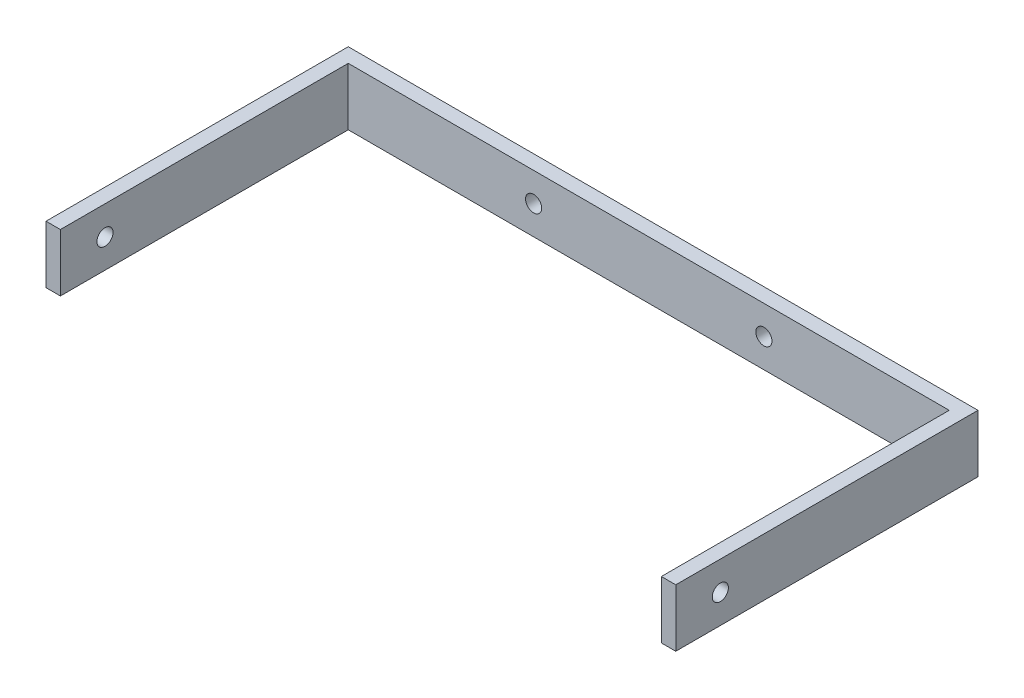
ISO-10303-21;
HEADER;
FILE_DESCRIPTION(('STEP AP214'),'2;1');
FILE_NAME('part.step','',(''),(''),'','','');
FILE_SCHEMA(('AUTOMOTIVE_DESIGN { 1 0 10303 214 1 1 1 1 }'));
ENDSEC;
DATA;
#1=APPLICATION_CONTEXT('core data for automotive mechanical design processes');
#2=APPLICATION_PROTOCOL_DEFINITION('international standard','automotive_design',2000,#1);
#3=PRODUCT_CONTEXT('',#1,'mechanical');
#4=PRODUCT('Part','Part','',(#3));
#5=PRODUCT_RELATED_PRODUCT_CATEGORY('part','',(#4));
#6=PRODUCT_DEFINITION_FORMATION('','',#4);
#7=PRODUCT_DEFINITION_CONTEXT('part definition',#1,'design');
#8=PRODUCT_DEFINITION('design','',#6,#7);
#9=PRODUCT_DEFINITION_SHAPE('','',#8);
#10=(LENGTH_UNIT() NAMED_UNIT(*) SI_UNIT(.MILLI.,.METRE.));
#11=(NAMED_UNIT(*) PLANE_ANGLE_UNIT() SI_UNIT($,.RADIAN.));
#12=(NAMED_UNIT(*) SI_UNIT($,.STERADIAN.) SOLID_ANGLE_UNIT());
#13=UNCERTAINTY_MEASURE_WITH_UNIT(LENGTH_MEASURE(1.E-05),#10,'distance_accuracy_value','');
#14=(GEOMETRIC_REPRESENTATION_CONTEXT(3) GLOBAL_UNCERTAINTY_ASSIGNED_CONTEXT((#13)) GLOBAL_UNIT_ASSIGNED_CONTEXT((#10,
#11,#12)) REPRESENTATION_CONTEXT('',''));
#15=CARTESIAN_POINT('',(0.,0.,0.));
#16=DIRECTION('',(0.,0.,1.));
#17=DIRECTION('',(1.,0.,0.));
#18=AXIS2_PLACEMENT_3D('',#15,#16,#17);
#19=CARTESIAN_POINT('',(0.,0.,3.175));
#20=DIRECTION('',(0.,0.,-1.));
#21=DIRECTION('',(-1.,0.,0.));
#22=AXIS2_PLACEMENT_3D('',#19,#20,#21);
#23=PLANE('',#22);
#24=CARTESIAN_POINT('',(-94.86280494,-6.35000000000001,3.175));
#25=DIRECTION('',(0.,0.,1.));
#26=DIRECTION('',(1.,0.,0.));
#27=AXIS2_PLACEMENT_3D('',#24,#25,#26);
#28=CIRCLE('',#27,1.77800000000001);
#29=CARTESIAN_POINT('',(-93.08480494,-6.35000000000001,3.175));
#30=VERTEX_POINT('',#29);
#31=EDGE_CURVE('E155',#30,#30,#28,.T.);
#32=ORIENTED_EDGE('',*,*,#31,.F.);
#33=EDGE_LOOP('',(#32));
#34=FACE_BOUND('',#33,.T.);
#35=CARTESIAN_POINT('',(-44.06280494,-6.35,3.175));
#36=DIRECTION('',(0.,0.,1.));
#37=DIRECTION('',(1.,0.,0.));
#38=AXIS2_PLACEMENT_3D('',#35,#36,#37);
#39=CIRCLE('',#38,1.77800000000001);
#40=CARTESIAN_POINT('',(-42.28480494,-6.35,3.175));
#41=VERTEX_POINT('',#40);
#42=EDGE_CURVE('E149',#41,#41,#39,.T.);
#43=ORIENTED_EDGE('',*,*,#42,.F.);
#44=EDGE_LOOP('',(#43));
#45=FACE_BOUND('',#44,.T.);
#46=DIRECTION('',(0.,-1.,0.));
#47=VECTOR('',#46,1.);
#48=CARTESIAN_POINT('',(-3.175,0.,3.175));
#49=LINE('',#48,#47);
#50=CARTESIAN_POINT('',(-3.175,0.,3.175));
#51=VERTEX_POINT('',#50);
#52=CARTESIAN_POINT('',(-3.175,-12.7,3.175));
#53=VERTEX_POINT('',#52);
#54=EDGE_CURVE('E49',#51,#53,#49,.T.);
#55=ORIENTED_EDGE('',*,*,#54,.F.);
#56=DIRECTION('',(-1.,0.,0.));
#57=VECTOR('',#56,1.);
#58=CARTESIAN_POINT('',(0.,0.,3.175));
#59=LINE('',#58,#57);
#60=CARTESIAN_POINT('',(-135.75060988,0.,3.175));
#61=VERTEX_POINT('',#60);
#62=EDGE_CURVE('E160',#51,#61,#59,.T.);
#63=ORIENTED_EDGE('',*,*,#62,.T.);
#64=DIRECTION('',(0.,1.,0.));
#65=VECTOR('',#64,1.);
#66=CARTESIAN_POINT('',(-135.75060988,0.,3.175));
#67=LINE('',#66,#65);
#68=CARTESIAN_POINT('',(-135.75060988,-12.7,3.175));
#69=VERTEX_POINT('',#68);
#70=EDGE_CURVE('E129',#69,#61,#67,.T.);
#71=ORIENTED_EDGE('',*,*,#70,.F.);
#72=DIRECTION('',(1.,0.,0.));
#73=VECTOR('',#72,1.);
#74=CARTESIAN_POINT('',(0.,-12.7,3.175));
#75=LINE('',#74,#73);
#76=EDGE_CURVE('E54',#69,#53,#75,.T.);
#77=ORIENTED_EDGE('',*,*,#76,.T.);
#78=EDGE_LOOP('',(#55,#63,#71,#77));
#79=FACE_BOUND('',#78,.T.);
#80=ADVANCED_FACE('F33',(#34,#45,#79),#23,.F.);
#81=CARTESIAN_POINT('',(0.,0.,0.));
#82=DIRECTION('',(0.,0.,-1.));
#83=DIRECTION('',(-1.,0.,0.));
#84=AXIS2_PLACEMENT_3D('',#81,#82,#83);
#85=PLANE('',#84);
#86=CARTESIAN_POINT('',(-94.86280494,-6.35000000000001,0.));
#87=DIRECTION('',(0.,0.,1.));
#88=DIRECTION('',(1.,0.,0.));
#89=AXIS2_PLACEMENT_3D('',#86,#87,#88);
#90=CIRCLE('',#89,1.77800000000001);
#91=CARTESIAN_POINT('',(-93.08480494,-6.35000000000001,0.));
#92=VERTEX_POINT('',#91);
#93=EDGE_CURVE('E152',#92,#92,#90,.T.);
#94=ORIENTED_EDGE('',*,*,#93,.T.);
#95=EDGE_LOOP('',(#94));
#96=FACE_BOUND('',#95,.T.);
#97=DIRECTION('',(0.,1.,0.));
#98=VECTOR('',#97,1.);
#99=CARTESIAN_POINT('',(0.,0.,0.));
#100=LINE('',#99,#98);
#101=CARTESIAN_POINT('',(0.,-12.7,0.));
#102=VERTEX_POINT('',#101);
#103=CARTESIAN_POINT('',(0.,0.,0.));
#104=VERTEX_POINT('',#103);
#105=EDGE_CURVE('E102',#102,#104,#100,.T.);
#106=ORIENTED_EDGE('',*,*,#105,.F.);
#107=DIRECTION('',(1.,0.,0.));
#108=VECTOR('',#107,1.);
#109=CARTESIAN_POINT('',(0.,-12.7,0.));
#110=LINE('',#109,#108);
#111=CARTESIAN_POINT('',(-138.92560988,-12.7,0.));
#112=VERTEX_POINT('',#111);
#113=EDGE_CURVE('E162',#112,#102,#110,.T.);
#114=ORIENTED_EDGE('',*,*,#113,.F.);
#115=DIRECTION('',(0.,-1.,0.));
#116=VECTOR('',#115,1.);
#117=CARTESIAN_POINT('',(-138.92560988,0.,0.));
#118=LINE('',#117,#116);
#119=CARTESIAN_POINT('',(-138.92560988,0.,0.));
#120=VERTEX_POINT('',#119);
#121=EDGE_CURVE('E168',#120,#112,#118,.T.);
#122=ORIENTED_EDGE('',*,*,#121,.F.);
#123=DIRECTION('',(-1.,0.,0.));
#124=VECTOR('',#123,1.);
#125=CARTESIAN_POINT('',(0.,0.,0.));
#126=LINE('',#125,#124);
#127=EDGE_CURVE('E166',#104,#120,#126,.T.);
#128=ORIENTED_EDGE('',*,*,#127,.F.);
#129=EDGE_LOOP('',(#106,#114,#122,#128));
#130=FACE_BOUND('',#129,.T.);
#131=CARTESIAN_POINT('',(-44.06280494,-6.35,0.));
#132=DIRECTION('',(0.,0.,1.));
#133=DIRECTION('',(1.,0.,0.));
#134=AXIS2_PLACEMENT_3D('',#131,#132,#133);
#135=CIRCLE('',#134,1.77800000000001);
#136=CARTESIAN_POINT('',(-42.28480494,-6.35,0.));
#137=VERTEX_POINT('',#136);
#138=EDGE_CURVE('E148',#137,#137,#135,.T.);
#139=ORIENTED_EDGE('',*,*,#138,.T.);
#140=EDGE_LOOP('',(#139));
#141=FACE_BOUND('',#140,.T.);
#142=ADVANCED_FACE('F183',(#96,#130,#141),#85,.T.);
#143=CARTESIAN_POINT('',(0.,0.,3.175));
#144=DIRECTION('',(-1.,0.,0.));
#145=DIRECTION('',(0.,-1.,0.));
#146=AXIS2_PLACEMENT_3D('',#143,#144,#145);
#147=PLANE('',#146);
#148=CARTESIAN_POINT('',(0.,-6.35,56.840236332));
#149=DIRECTION('',(1.,0.,0.));
#150=DIRECTION('',(0.,1.,0.));
#151=AXIS2_PLACEMENT_3D('',#148,#149,#150);
#152=CIRCLE('',#151,1.778);
#153=CARTESIAN_POINT('',(0.,-4.572,56.840236332));
#154=VERTEX_POINT('',#153);
#155=EDGE_CURVE('E240',#154,#154,#152,.T.);
#156=ORIENTED_EDGE('',*,*,#155,.F.);
#157=EDGE_LOOP('',(#156));
#158=FACE_BOUND('',#157,.T.);
#159=ORIENTED_EDGE('',*,*,#105,.T.);
#160=DIRECTION('',(0.,0.,-1.));
#161=VECTOR('',#160,1.);
#162=CARTESIAN_POINT('',(0.,0.,3.175));
#163=LINE('',#162,#161);
#164=CARTESIAN_POINT('',(0.,0.,66.675));
#165=VERTEX_POINT('',#164);
#166=EDGE_CURVE('E11',#165,#104,#163,.T.);
#167=ORIENTED_EDGE('',*,*,#166,.F.);
#168=DIRECTION('',(0.,1.,0.));
#169=VECTOR('',#168,1.);
#170=CARTESIAN_POINT('',(0.,0.,66.675));
#171=LINE('',#170,#169);
#172=CARTESIAN_POINT('',(0.,-12.7,66.675));
#173=VERTEX_POINT('',#172);
#174=EDGE_CURVE('E100',#173,#165,#171,.T.);
#175=ORIENTED_EDGE('',*,*,#174,.F.);
#176=DIRECTION('',(0.,0.,-1.));
#177=VECTOR('',#176,1.);
#178=CARTESIAN_POINT('',(0.,-12.7,3.175));
#179=LINE('',#178,#177);
#180=EDGE_CURVE('E164',#173,#102,#179,.T.);
#181=ORIENTED_EDGE('',*,*,#180,.T.);
#182=EDGE_LOOP('',(#159,#167,#175,#181));
#183=FACE_BOUND('',#182,.T.);
#184=ADVANCED_FACE('F35',(#158,#183),#147,.F.);
#185=CARTESIAN_POINT('',(0.,0.,3.175));
#186=DIRECTION('',(0.,-1.,0.));
#187=DIRECTION('',(0.,0.,-1.));
#188=AXIS2_PLACEMENT_3D('',#185,#186,#187);
#189=PLANE('',#188);
#190=ORIENTED_EDGE('',*,*,#127,.T.);
#191=DIRECTION('',(0.,0.,-1.));
#192=VECTOR('',#191,1.);
#193=CARTESIAN_POINT('',(-138.92560988,0.,3.175));
#194=LINE('',#193,#192);
#195=CARTESIAN_POINT('',(-138.92560988,0.,66.675));
#196=VERTEX_POINT('',#195);
#197=EDGE_CURVE('E42',#196,#120,#194,.T.);
#198=ORIENTED_EDGE('',*,*,#197,.F.);
#199=DIRECTION('',(-1.,0.,0.));
#200=VECTOR('',#199,1.);
#201=CARTESIAN_POINT('',(-138.92560988,0.,66.675));
#202=LINE('',#201,#200);
#203=CARTESIAN_POINT('',(-135.75060988,0.,66.675));
#204=VERTEX_POINT('',#203);
#205=EDGE_CURVE('E137',#204,#196,#202,.T.);
#206=ORIENTED_EDGE('',*,*,#205,.F.);
#207=DIRECTION('',(0.,0.,-1.));
#208=VECTOR('',#207,1.);
#209=CARTESIAN_POINT('',(-135.75060988,0.,66.675));
#210=LINE('',#209,#208);
#211=EDGE_CURVE('E140',#204,#61,#210,.T.);
#212=ORIENTED_EDGE('',*,*,#211,.T.);
#213=ORIENTED_EDGE('',*,*,#62,.F.);
#214=DIRECTION('',(0.,0.,-1.));
#215=VECTOR('',#214,1.);
#216=CARTESIAN_POINT('',(-3.175,0.,66.675));
#217=LINE('',#216,#215);
#218=CARTESIAN_POINT('',(-3.175,0.,66.675));
#219=VERTEX_POINT('',#218);
#220=EDGE_CURVE('E108',#219,#51,#217,.T.);
#221=ORIENTED_EDGE('',*,*,#220,.F.);
#222=DIRECTION('',(-1.,0.,0.));
#223=VECTOR('',#222,1.);
#224=CARTESIAN_POINT('',(0.,0.,66.675));
#225=LINE('',#224,#223);
#226=EDGE_CURVE('E105',#165,#219,#225,.T.);
#227=ORIENTED_EDGE('',*,*,#226,.F.);
#228=ORIENTED_EDGE('',*,*,#166,.T.);
#229=EDGE_LOOP('',(#190,#198,#206,#212,#213,#221,#227,#228));
#230=FACE_BOUND('',#229,.T.);
#231=ADVANCED_FACE('F106',(#230),#189,.F.);
#232=CARTESIAN_POINT('',(-138.92560988,0.,3.175));
#233=DIRECTION('',(1.,0.,0.));
#234=DIRECTION('',(0.,0.,-1.));
#235=AXIS2_PLACEMENT_3D('',#232,#233,#234);
#236=PLANE('',#235);
#237=CARTESIAN_POINT('',(-138.92560988,-6.35000000000002,56.840236332));
#238=DIRECTION('',(1.,0.,0.));
#239=DIRECTION('',(0.,0.,-1.));
#240=AXIS2_PLACEMENT_3D('',#237,#238,#239);
#241=CIRCLE('',#240,1.778);
#242=CARTESIAN_POINT('',(-138.92560988,-6.35000000000002,55.062236332));
#243=VERTEX_POINT('',#242);
#244=EDGE_CURVE('E118',#243,#243,#241,.T.);
#245=ORIENTED_EDGE('',*,*,#244,.T.);
#246=EDGE_LOOP('',(#245));
#247=FACE_BOUND('',#246,.T.);
#248=ORIENTED_EDGE('',*,*,#121,.T.);
#249=DIRECTION('',(0.,0.,-1.));
#250=VECTOR('',#249,1.);
#251=CARTESIAN_POINT('',(-138.92560988,-12.7,3.175));
#252=LINE('',#251,#250);
#253=CARTESIAN_POINT('',(-138.92560988,-12.7,66.675));
#254=VERTEX_POINT('',#253);
#255=EDGE_CURVE('E172',#254,#112,#252,.T.);
#256=ORIENTED_EDGE('',*,*,#255,.F.);
#257=DIRECTION('',(0.,-1.,0.));
#258=VECTOR('',#257,1.);
#259=CARTESIAN_POINT('',(-138.92560988,0.,66.675));
#260=LINE('',#259,#258);
#261=EDGE_CURVE('E130',#196,#254,#260,.T.);
#262=ORIENTED_EDGE('',*,*,#261,.F.);
#263=ORIENTED_EDGE('',*,*,#197,.T.);
#264=EDGE_LOOP('',(#248,#256,#262,#263));
#265=FACE_BOUND('',#264,.T.);
#266=ADVANCED_FACE('F179',(#247,#265),#236,.F.);
#267=CARTESIAN_POINT('',(0.,-12.7,3.175));
#268=DIRECTION('',(0.,1.,0.));
#269=DIRECTION('',(-1.,0.,0.));
#270=AXIS2_PLACEMENT_3D('',#267,#268,#269);
#271=PLANE('',#270);
#272=ORIENTED_EDGE('',*,*,#113,.T.);
#273=ORIENTED_EDGE('',*,*,#180,.F.);
#274=DIRECTION('',(1.,0.,0.));
#275=VECTOR('',#274,1.);
#276=CARTESIAN_POINT('',(0.,-12.7,66.675));
#277=LINE('',#276,#275);
#278=CARTESIAN_POINT('',(-3.175,-12.7,66.675));
#279=VERTEX_POINT('',#278);
#280=EDGE_CURVE('E116',#279,#173,#277,.T.);
#281=ORIENTED_EDGE('',*,*,#280,.F.);
#282=DIRECTION('',(0.,0.,-1.));
#283=VECTOR('',#282,1.);
#284=CARTESIAN_POINT('',(-3.175,-12.7,66.675));
#285=LINE('',#284,#283);
#286=EDGE_CURVE('E124',#279,#53,#285,.T.);
#287=ORIENTED_EDGE('',*,*,#286,.T.);
#288=ORIENTED_EDGE('',*,*,#76,.F.);
#289=DIRECTION('',(0.,0.,-1.));
#290=VECTOR('',#289,1.);
#291=CARTESIAN_POINT('',(-135.75060988,-12.7,66.675));
#292=LINE('',#291,#290);
#293=CARTESIAN_POINT('',(-135.75060988,-12.7,66.675));
#294=VERTEX_POINT('',#293);
#295=EDGE_CURVE('E145',#294,#69,#292,.T.);
#296=ORIENTED_EDGE('',*,*,#295,.F.);
#297=DIRECTION('',(1.,0.,0.));
#298=VECTOR('',#297,1.);
#299=CARTESIAN_POINT('',(-138.92560988,-12.7,66.675));
#300=LINE('',#299,#298);
#301=EDGE_CURVE('E133',#254,#294,#300,.T.);
#302=ORIENTED_EDGE('',*,*,#301,.F.);
#303=ORIENTED_EDGE('',*,*,#255,.T.);
#304=EDGE_LOOP('',(#272,#273,#281,#287,#288,#296,#302,#303));
#305=FACE_BOUND('',#304,.T.);
#306=ADVANCED_FACE('F186',(#305),#271,.F.);
#307=CARTESIAN_POINT('',(-94.86280494,-6.35000000000001,3.175));
#308=DIRECTION('',(0.,0.,-1.));
#309=DIRECTION('',(-1.,0.,0.));
#310=AXIS2_PLACEMENT_3D('',#307,#308,#309);
#311=CYLINDRICAL_SURFACE('',#310,1.77800000000001);
#312=ORIENTED_EDGE('',*,*,#31,.T.);
#313=EDGE_LOOP('',(#312));
#314=FACE_BOUND('',#313,.T.);
#315=ORIENTED_EDGE('',*,*,#93,.F.);
#316=EDGE_LOOP('',(#315));
#317=FACE_BOUND('',#316,.T.);
#318=ADVANCED_FACE('F222',(#314,#317),#311,.F.);
#319=CARTESIAN_POINT('',(-44.06280494,-6.35,3.175));
#320=DIRECTION('',(0.,0.,-1.));
#321=DIRECTION('',(-1.,0.,0.));
#322=AXIS2_PLACEMENT_3D('',#319,#320,#321);
#323=CYLINDRICAL_SURFACE('',#322,1.77800000000001);
#324=ORIENTED_EDGE('',*,*,#42,.T.);
#325=EDGE_LOOP('',(#324));
#326=FACE_BOUND('',#325,.T.);
#327=ORIENTED_EDGE('',*,*,#138,.F.);
#328=EDGE_LOOP('',(#327));
#329=FACE_BOUND('',#328,.T.);
#330=ADVANCED_FACE('F278',(#326,#329),#323,.F.);
#331=CARTESIAN_POINT('',(-135.75060988,0.,66.675));
#332=DIRECTION('',(-1.,0.,0.));
#333=DIRECTION('',(0.,0.,1.));
#334=AXIS2_PLACEMENT_3D('',#331,#332,#333);
#335=PLANE('',#334);
#336=CARTESIAN_POINT('',(-135.75060988,-6.35000000000002,56.840236332));
#337=DIRECTION('',(-1.,0.,0.));
#338=DIRECTION('',(0.,0.,1.));
#339=AXIS2_PLACEMENT_3D('',#336,#337,#338);
#340=CIRCLE('',#339,1.778);
#341=CARTESIAN_POINT('',(-135.75060988,-6.35000000000002,58.618236332));
#342=VERTEX_POINT('',#341);
#343=EDGE_CURVE('E243',#342,#342,#340,.T.);
#344=ORIENTED_EDGE('',*,*,#343,.T.);
#345=EDGE_LOOP('',(#344));
#346=FACE_BOUND('',#345,.T.);
#347=ORIENTED_EDGE('',*,*,#70,.T.);
#348=ORIENTED_EDGE('',*,*,#211,.F.);
#349=DIRECTION('',(0.,1.,0.));
#350=VECTOR('',#349,1.);
#351=CARTESIAN_POINT('',(-135.75060988,0.,66.675));
#352=LINE('',#351,#350);
#353=EDGE_CURVE('E135',#294,#204,#352,.T.);
#354=ORIENTED_EDGE('',*,*,#353,.F.);
#355=ORIENTED_EDGE('',*,*,#295,.T.);
#356=EDGE_LOOP('',(#347,#348,#354,#355));
#357=FACE_BOUND('',#356,.T.);
#358=ADVANCED_FACE('F194',(#346,#357),#335,.F.);
#359=CARTESIAN_POINT('',(0.,0.,66.675));
#360=DIRECTION('',(0.,0.,1.));
#361=DIRECTION('',(1.,0.,0.));
#362=AXIS2_PLACEMENT_3D('',#359,#360,#361);
#363=PLANE('',#362);
#364=ORIENTED_EDGE('',*,*,#261,.T.);
#365=ORIENTED_EDGE('',*,*,#301,.T.);
#366=ORIENTED_EDGE('',*,*,#353,.T.);
#367=ORIENTED_EDGE('',*,*,#205,.T.);
#368=EDGE_LOOP('',(#364,#365,#366,#367));
#369=FACE_BOUND('',#368,.T.);
#370=ADVANCED_FACE('F191',(#369),#363,.T.);
#371=CARTESIAN_POINT('',(-3.175,0.,66.675));
#372=DIRECTION('',(1.,0.,0.));
#373=DIRECTION('',(0.,1.,0.));
#374=AXIS2_PLACEMENT_3D('',#371,#372,#373);
#375=PLANE('',#374);
#376=CARTESIAN_POINT('',(-3.17500000000001,-6.35,56.840236332));
#377=DIRECTION('',(1.,0.,0.));
#378=DIRECTION('',(0.,1.,0.));
#379=AXIS2_PLACEMENT_3D('',#376,#377,#378);
#380=CIRCLE('',#379,1.778);
#381=CARTESIAN_POINT('',(-3.17500000000001,-4.572,56.840236332));
#382=VERTEX_POINT('',#381);
#383=EDGE_CURVE('E37',#382,#382,#380,.T.);
#384=ORIENTED_EDGE('',*,*,#383,.T.);
#385=EDGE_LOOP('',(#384));
#386=FACE_BOUND('',#385,.T.);
#387=ORIENTED_EDGE('',*,*,#54,.T.);
#388=ORIENTED_EDGE('',*,*,#286,.F.);
#389=DIRECTION('',(0.,-1.,0.));
#390=VECTOR('',#389,1.);
#391=CARTESIAN_POINT('',(-3.175,0.,66.675));
#392=LINE('',#391,#390);
#393=EDGE_CURVE('E111',#219,#279,#392,.T.);
#394=ORIENTED_EDGE('',*,*,#393,.F.);
#395=ORIENTED_EDGE('',*,*,#220,.T.);
#396=EDGE_LOOP('',(#387,#388,#394,#395));
#397=FACE_BOUND('',#396,.T.);
#398=ADVANCED_FACE('F197',(#386,#397),#375,.F.);
#399=CARTESIAN_POINT('',(0.,0.,66.675));
#400=DIRECTION('',(0.,0.,-1.));
#401=DIRECTION('',(-1.,0.,0.));
#402=AXIS2_PLACEMENT_3D('',#399,#400,#401);
#403=PLANE('',#402);
#404=ORIENTED_EDGE('',*,*,#174,.T.);
#405=ORIENTED_EDGE('',*,*,#226,.T.);
#406=ORIENTED_EDGE('',*,*,#393,.T.);
#407=ORIENTED_EDGE('',*,*,#280,.T.);
#408=EDGE_LOOP('',(#404,#405,#406,#407));
#409=FACE_BOUND('',#408,.T.);
#410=ADVANCED_FACE('F114',(#409),#403,.F.);
#411=CARTESIAN_POINT('',(-152.4,-6.35000000000002,56.840236332));
#412=DIRECTION('',(1.,0.,0.));
#413=DIRECTION('',(0.,1.,0.));
#414=AXIS2_PLACEMENT_3D('',#411,#412,#413);
#415=CYLINDRICAL_SURFACE('',#414,1.778);
#416=ORIENTED_EDGE('',*,*,#155,.T.);
#417=EDGE_LOOP('',(#416));
#418=FACE_BOUND('',#417,.T.);
#419=ORIENTED_EDGE('',*,*,#383,.F.);
#420=EDGE_LOOP('',(#419));
#421=FACE_BOUND('',#420,.T.);
#422=ADVANCED_FACE('F206',(#418,#421),#415,.F.);
#423=ORIENTED_EDGE('',*,*,#343,.F.);
#424=EDGE_LOOP('',(#423));
#425=FACE_BOUND('',#424,.T.);
#426=ORIENTED_EDGE('',*,*,#244,.F.);
#427=EDGE_LOOP('',(#426));
#428=FACE_BOUND('',#427,.T.);
#429=ADVANCED_FACE('F250',(#425,#428),#415,.F.);
#430=CLOSED_SHELL('',(#80,#142,#184,#231,#266,#306,#318,#330,#358,#370,#398,#410,#422,#429));
#431=MANIFOLD_SOLID_BREP('B2',#430);
#432=ADVANCED_BREP_SHAPE_REPRESENTATION('',(#18,#431),#14);
#433=SHAPE_DEFINITION_REPRESENTATION(#9,#432);
ENDSEC;
END-ISO-10303-21;
